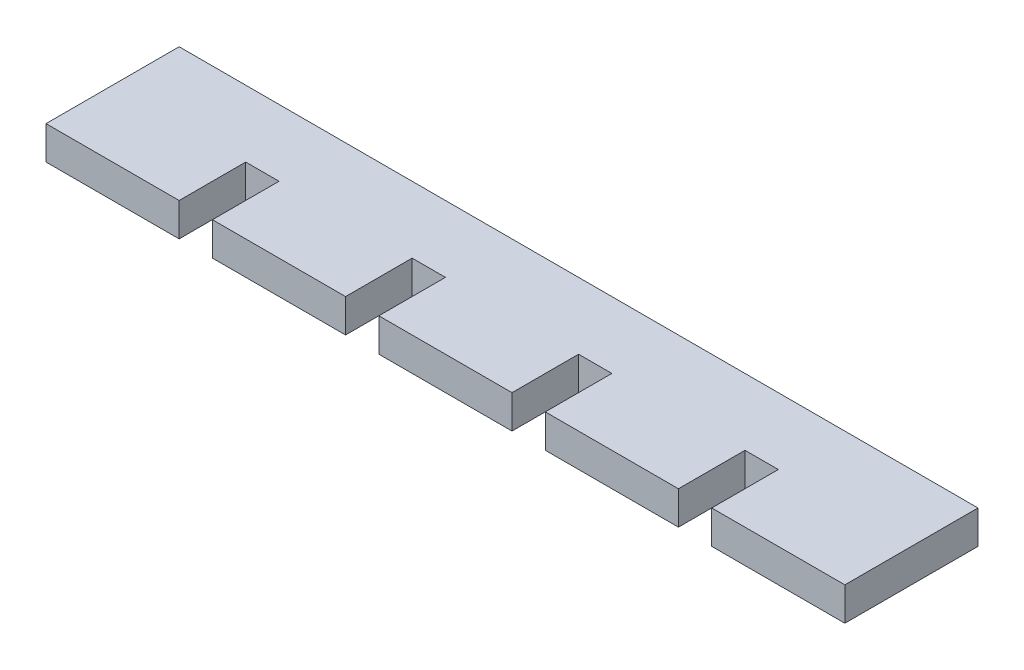
ISO-10303-21;
HEADER;
FILE_DESCRIPTION(('STEP AP214'),'2;1');
FILE_NAME('part.step','',(''),(''),'','','');
FILE_SCHEMA(('AUTOMOTIVE_DESIGN { 1 0 10303 214 1 1 1 1 }'));
ENDSEC;
DATA;
#1=APPLICATION_CONTEXT('core data for automotive mechanical design processes');
#2=APPLICATION_PROTOCOL_DEFINITION('international standard','automotive_design',2000,#1);
#3=PRODUCT_CONTEXT('',#1,'mechanical');
#4=PRODUCT('Part','Part','',(#3));
#5=PRODUCT_RELATED_PRODUCT_CATEGORY('part','',(#4));
#6=PRODUCT_DEFINITION_FORMATION('','',#4);
#7=PRODUCT_DEFINITION_CONTEXT('part definition',#1,'design');
#8=PRODUCT_DEFINITION('design','',#6,#7);
#9=PRODUCT_DEFINITION_SHAPE('','',#8);
#10=(LENGTH_UNIT() NAMED_UNIT(*) SI_UNIT(.MILLI.,.METRE.));
#11=(NAMED_UNIT(*) PLANE_ANGLE_UNIT() SI_UNIT($,.RADIAN.));
#12=(NAMED_UNIT(*) SI_UNIT($,.STERADIAN.) SOLID_ANGLE_UNIT());
#13=UNCERTAINTY_MEASURE_WITH_UNIT(LENGTH_MEASURE(1.E-05),#10,'distance_accuracy_value','');
#14=(GEOMETRIC_REPRESENTATION_CONTEXT(3) GLOBAL_UNCERTAINTY_ASSIGNED_CONTEXT((#13)) GLOBAL_UNIT_ASSIGNED_CONTEXT((#10,
#11,#12)) REPRESENTATION_CONTEXT('',''));
#15=CARTESIAN_POINT('',(0.,0.,0.));
#16=DIRECTION('',(0.,0.,1.));
#17=DIRECTION('',(1.,0.,0.));
#18=AXIS2_PLACEMENT_3D('',#15,#16,#17);
#19=CARTESIAN_POINT('',(0.,3.175,12.7));
#20=DIRECTION('',(0.,0.,-1.));
#21=DIRECTION('',(-1.,0.,0.));
#22=AXIS2_PLACEMENT_3D('',#19,#20,#21);
#23=PLANE('',#22);
#24=DIRECTION('',(1.,0.,0.));
#25=VECTOR('',#24,1.);
#26=CARTESIAN_POINT('',(0.,3.175,12.7));
#27=LINE('',#26,#25);
#28=CARTESIAN_POINT('',(31.75,3.175,12.7));
#29=VERTEX_POINT('',#28);
#30=CARTESIAN_POINT('',(44.45,3.175,12.7));
#31=VERTEX_POINT('',#30);
#32=EDGE_CURVE('E338',#29,#31,#27,.T.);
#33=ORIENTED_EDGE('',*,*,#32,.F.);
#34=DIRECTION('',(0.,1.,0.));
#35=VECTOR('',#34,1.);
#36=CARTESIAN_POINT('',(31.75,0.,12.7));
#37=LINE('',#36,#35);
#38=CARTESIAN_POINT('',(31.75,0.,12.7));
#39=VERTEX_POINT('',#38);
#40=EDGE_CURVE('E208',#39,#29,#37,.T.);
#41=ORIENTED_EDGE('',*,*,#40,.F.);
#42=DIRECTION('',(1.,0.,0.));
#43=VECTOR('',#42,1.);
#44=CARTESIAN_POINT('',(0.,0.,12.7));
#45=LINE('',#44,#43);
#46=CARTESIAN_POINT('',(44.45,0.,12.7));
#47=VERTEX_POINT('',#46);
#48=EDGE_CURVE('E352',#39,#47,#45,.T.);
#49=ORIENTED_EDGE('',*,*,#48,.T.);
#50=DIRECTION('',(0.,1.,0.));
#51=VECTOR('',#50,1.);
#52=CARTESIAN_POINT('',(44.45,0.,12.7));
#53=LINE('',#52,#51);
#54=EDGE_CURVE('E56',#47,#31,#53,.T.);
#55=ORIENTED_EDGE('',*,*,#54,.T.);
#56=EDGE_LOOP('',(#33,#41,#49,#55));
#57=FACE_BOUND('',#56,.T.);
#58=ADVANCED_FACE('F33',(#57),#23,.F.);
#59=CARTESIAN_POINT('',(47.625,3.175,12.7));
#60=VERTEX_POINT('',#59);
#61=CARTESIAN_POINT('',(60.325,3.175,12.7));
#62=VERTEX_POINT('',#61);
#63=EDGE_CURVE('E336',#60,#62,#27,.T.);
#64=ORIENTED_EDGE('',*,*,#63,.F.);
#65=DIRECTION('',(0.,1.,0.));
#66=VECTOR('',#65,1.);
#67=CARTESIAN_POINT('',(47.625,0.,12.7));
#68=LINE('',#67,#66);
#69=CARTESIAN_POINT('',(47.625,0.,12.7));
#70=VERTEX_POINT('',#69);
#71=EDGE_CURVE('E230',#70,#60,#68,.T.);
#72=ORIENTED_EDGE('',*,*,#71,.F.);
#73=CARTESIAN_POINT('',(60.325,0.,12.7));
#74=VERTEX_POINT('',#73);
#75=EDGE_CURVE('E354',#70,#74,#45,.T.);
#76=ORIENTED_EDGE('',*,*,#75,.T.);
#77=DIRECTION('',(0.,1.,0.));
#78=VECTOR('',#77,1.);
#79=CARTESIAN_POINT('',(60.325,0.,12.7));
#80=LINE('',#79,#78);
#81=EDGE_CURVE('E48',#74,#62,#80,.T.);
#82=ORIENTED_EDGE('',*,*,#81,.T.);
#83=EDGE_LOOP('',(#64,#72,#76,#82));
#84=FACE_BOUND('',#83,.T.);
#85=ADVANCED_FACE('F381',(#84),#23,.F.);
#86=CARTESIAN_POINT('',(63.5,3.175,12.7));
#87=VERTEX_POINT('',#86);
#88=CARTESIAN_POINT('',(76.2,3.175,12.7));
#89=VERTEX_POINT('',#88);
#90=EDGE_CURVE('E285',#87,#89,#27,.T.);
#91=ORIENTED_EDGE('',*,*,#90,.F.);
#92=DIRECTION('',(0.,1.,0.));
#93=VECTOR('',#92,1.);
#94=CARTESIAN_POINT('',(63.5,0.,12.7));
#95=LINE('',#94,#93);
#96=CARTESIAN_POINT('',(63.5,0.,12.7));
#97=VERTEX_POINT('',#96);
#98=EDGE_CURVE('E252',#97,#87,#95,.T.);
#99=ORIENTED_EDGE('',*,*,#98,.F.);
#100=CARTESIAN_POINT('',(76.2,0.,12.7));
#101=VERTEX_POINT('',#100);
#102=EDGE_CURVE('E298',#97,#101,#45,.T.);
#103=ORIENTED_EDGE('',*,*,#102,.T.);
#104=DIRECTION('',(0.,-1.,0.));
#105=VECTOR('',#104,1.);
#106=CARTESIAN_POINT('',(76.2,3.175,12.7));
#107=LINE('',#106,#105);
#108=EDGE_CURVE('E41',#89,#101,#107,.T.);
#109=ORIENTED_EDGE('',*,*,#108,.F.);
#110=EDGE_LOOP('',(#91,#99,#103,#109));
#111=FACE_BOUND('',#110,.T.);
#112=ADVANCED_FACE('F361',(#111),#23,.F.);
#113=CARTESIAN_POINT('',(15.875,0.,12.7));
#114=VERTEX_POINT('',#113);
#115=CARTESIAN_POINT('',(28.575,0.,12.7));
#116=VERTEX_POINT('',#115);
#117=EDGE_CURVE('E303',#114,#116,#45,.T.);
#118=ORIENTED_EDGE('',*,*,#117,.T.);
#119=DIRECTION('',(0.,1.,0.));
#120=VECTOR('',#119,1.);
#121=CARTESIAN_POINT('',(28.575,0.,12.7));
#122=LINE('',#121,#120);
#123=CARTESIAN_POINT('',(28.575,3.175,12.7));
#124=VERTEX_POINT('',#123);
#125=EDGE_CURVE('E182',#116,#124,#122,.T.);
#126=ORIENTED_EDGE('',*,*,#125,.T.);
#127=CARTESIAN_POINT('',(15.875,3.175,12.7));
#128=VERTEX_POINT('',#127);
#129=EDGE_CURVE('E291',#128,#124,#27,.T.);
#130=ORIENTED_EDGE('',*,*,#129,.F.);
#131=DIRECTION('',(0.,1.,0.));
#132=VECTOR('',#131,1.);
#133=CARTESIAN_POINT('',(15.875,0.,12.7));
#134=LINE('',#133,#132);
#135=EDGE_CURVE('E276',#114,#128,#134,.T.);
#136=ORIENTED_EDGE('',*,*,#135,.F.);
#137=EDGE_LOOP('',(#118,#126,#130,#136));
#138=FACE_BOUND('',#137,.T.);
#139=ADVANCED_FACE('F351',(#138),#23,.F.);
#140=CARTESIAN_POINT('',(0.,3.175,0.));
#141=DIRECTION('',(1.,0.,0.));
#142=DIRECTION('',(0.,0.,-1.));
#143=AXIS2_PLACEMENT_3D('',#140,#141,#142);
#144=PLANE('',#143);
#145=DIRECTION('',(0.,0.,1.));
#146=VECTOR('',#145,1.);
#147=CARTESIAN_POINT('',(0.,0.,0.));
#148=LINE('',#147,#146);
#149=CARTESIAN_POINT('',(0.,0.,0.));
#150=VERTEX_POINT('',#149);
#151=CARTESIAN_POINT('',(0.,0.,12.7));
#152=VERTEX_POINT('',#151);
#153=EDGE_CURVE('E275',#150,#152,#148,.T.);
#154=ORIENTED_EDGE('',*,*,#153,.T.);
#155=DIRECTION('',(0.,-1.,0.));
#156=VECTOR('',#155,1.);
#157=CARTESIAN_POINT('',(0.,3.175,12.7));
#158=LINE('',#157,#156);
#159=CARTESIAN_POINT('',(0.,3.175,12.7));
#160=VERTEX_POINT('',#159);
#161=EDGE_CURVE('E11',#160,#152,#158,.T.);
#162=ORIENTED_EDGE('',*,*,#161,.F.);
#163=DIRECTION('',(0.,0.,1.));
#164=VECTOR('',#163,1.);
#165=CARTESIAN_POINT('',(0.,3.175,0.));
#166=LINE('',#165,#164);
#167=CARTESIAN_POINT('',(0.,3.175,0.));
#168=VERTEX_POINT('',#167);
#169=EDGE_CURVE('E282',#168,#160,#166,.T.);
#170=ORIENTED_EDGE('',*,*,#169,.F.);
#171=DIRECTION('',(0.,-1.,0.));
#172=VECTOR('',#171,1.);
#173=CARTESIAN_POINT('',(0.,3.175,0.));
#174=LINE('',#173,#172);
#175=EDGE_CURVE('E295',#168,#150,#174,.T.);
#176=ORIENTED_EDGE('',*,*,#175,.T.);
#177=EDGE_LOOP('',(#154,#162,#170,#176));
#178=FACE_BOUND('',#177,.T.);
#179=ADVANCED_FACE('F35',(#178),#144,.F.);
#180=CARTESIAN_POINT('',(12.7,0.,12.7));
#181=VERTEX_POINT('',#180);
#182=EDGE_CURVE('E299',#152,#181,#45,.T.);
#183=ORIENTED_EDGE('',*,*,#182,.T.);
#184=DIRECTION('',(0.,1.,0.));
#185=VECTOR('',#184,1.);
#186=CARTESIAN_POINT('',(12.7,0.,12.7));
#187=LINE('',#186,#185);
#188=CARTESIAN_POINT('',(12.7,3.175,12.7));
#189=VERTEX_POINT('',#188);
#190=EDGE_CURVE('E278',#181,#189,#187,.T.);
#191=ORIENTED_EDGE('',*,*,#190,.T.);
#192=EDGE_CURVE('E287',#160,#189,#27,.T.);
#193=ORIENTED_EDGE('',*,*,#192,.F.);
#194=ORIENTED_EDGE('',*,*,#161,.T.);
#195=EDGE_LOOP('',(#183,#191,#193,#194));
#196=FACE_BOUND('',#195,.T.);
#197=ADVANCED_FACE('F382',(#196),#23,.F.);
#198=CARTESIAN_POINT('',(76.2,3.175,0.));
#199=DIRECTION('',(-1.,0.,0.));
#200=DIRECTION('',(0.,0.,1.));
#201=AXIS2_PLACEMENT_3D('',#198,#199,#200);
#202=PLANE('',#201);
#203=DIRECTION('',(0.,0.,-1.));
#204=VECTOR('',#203,1.);
#205=CARTESIAN_POINT('',(76.2,0.,0.));
#206=LINE('',#205,#204);
#207=CARTESIAN_POINT('',(76.2,0.,0.));
#208=VERTEX_POINT('',#207);
#209=EDGE_CURVE('E302',#101,#208,#206,.T.);
#210=ORIENTED_EDGE('',*,*,#209,.T.);
#211=DIRECTION('',(0.,-1.,0.));
#212=VECTOR('',#211,1.);
#213=CARTESIAN_POINT('',(76.2,3.175,0.));
#214=LINE('',#213,#212);
#215=CARTESIAN_POINT('',(76.2,3.175,0.));
#216=VERTEX_POINT('',#215);
#217=EDGE_CURVE('E308',#216,#208,#214,.T.);
#218=ORIENTED_EDGE('',*,*,#217,.F.);
#219=DIRECTION('',(0.,0.,-1.));
#220=VECTOR('',#219,1.);
#221=CARTESIAN_POINT('',(76.2,3.175,0.));
#222=LINE('',#221,#220);
#223=EDGE_CURVE('E290',#89,#216,#222,.T.);
#224=ORIENTED_EDGE('',*,*,#223,.F.);
#225=ORIENTED_EDGE('',*,*,#108,.T.);
#226=EDGE_LOOP('',(#210,#218,#224,#225));
#227=FACE_BOUND('',#226,.T.);
#228=ADVANCED_FACE('F315',(#227),#202,.F.);
#229=CARTESIAN_POINT('',(0.,3.175,0.));
#230=DIRECTION('',(0.,0.,1.));
#231=DIRECTION('',(1.,0.,0.));
#232=AXIS2_PLACEMENT_3D('',#229,#230,#231);
#233=PLANE('',#232);
#234=DIRECTION('',(-1.,0.,0.));
#235=VECTOR('',#234,1.);
#236=CARTESIAN_POINT('',(0.,0.,0.));
#237=LINE('',#236,#235);
#238=EDGE_CURVE('E286',#208,#150,#237,.T.);
#239=ORIENTED_EDGE('',*,*,#238,.T.);
#240=ORIENTED_EDGE('',*,*,#175,.F.);
#241=DIRECTION('',(-1.,0.,0.));
#242=VECTOR('',#241,1.);
#243=CARTESIAN_POINT('',(0.,3.175,0.));
#244=LINE('',#243,#242);
#245=EDGE_CURVE('E293',#216,#168,#244,.T.);
#246=ORIENTED_EDGE('',*,*,#245,.F.);
#247=ORIENTED_EDGE('',*,*,#217,.T.);
#248=EDGE_LOOP('',(#239,#240,#246,#247));
#249=FACE_BOUND('',#248,.T.);
#250=ADVANCED_FACE('F324',(#249),#233,.F.);
#251=CARTESIAN_POINT('',(0.,3.175,0.));
#252=DIRECTION('',(0.,1.,0.));
#253=DIRECTION('',(0.,0.,1.));
#254=AXIS2_PLACEMENT_3D('',#251,#252,#253);
#255=PLANE('',#254);
#256=DIRECTION('',(0.,0.,-1.));
#257=VECTOR('',#256,1.);
#258=CARTESIAN_POINT('',(31.75,3.175,6.35000000000001));
#259=LINE('',#258,#257);
#260=CARTESIAN_POINT('',(31.75,3.175,6.35000000000001));
#261=VERTEX_POINT('',#260);
#262=EDGE_CURVE('E195',#29,#261,#259,.T.);
#263=ORIENTED_EDGE('',*,*,#262,.F.);
#264=ORIENTED_EDGE('',*,*,#32,.T.);
#265=DIRECTION('',(0.,0.,1.));
#266=VECTOR('',#265,1.);
#267=CARTESIAN_POINT('',(44.45,3.175,6.35000000000001));
#268=LINE('',#267,#266);
#269=CARTESIAN_POINT('',(44.45,3.175,6.35000000000001));
#270=VERTEX_POINT('',#269);
#271=EDGE_CURVE('E224',#270,#31,#268,.T.);
#272=ORIENTED_EDGE('',*,*,#271,.F.);
#273=DIRECTION('',(-1.,0.,0.));
#274=VECTOR('',#273,1.);
#275=CARTESIAN_POINT('',(44.45,3.175,6.35000000000001));
#276=LINE('',#275,#274);
#277=CARTESIAN_POINT('',(47.625,3.175,6.35000000000001));
#278=VERTEX_POINT('',#277);
#279=EDGE_CURVE('E221',#278,#270,#276,.T.);
#280=ORIENTED_EDGE('',*,*,#279,.F.);
#281=DIRECTION('',(0.,0.,-1.));
#282=VECTOR('',#281,1.);
#283=CARTESIAN_POINT('',(47.625,3.175,6.35000000000001));
#284=LINE('',#283,#282);
#285=EDGE_CURVE('E215',#60,#278,#284,.T.);
#286=ORIENTED_EDGE('',*,*,#285,.F.);
#287=ORIENTED_EDGE('',*,*,#63,.T.);
#288=DIRECTION('',(0.,0.,1.));
#289=VECTOR('',#288,1.);
#290=CARTESIAN_POINT('',(60.325,3.175,6.35000000000001));
#291=LINE('',#290,#289);
#292=CARTESIAN_POINT('',(60.325,3.175,6.35000000000001));
#293=VERTEX_POINT('',#292);
#294=EDGE_CURVE('E247',#293,#62,#291,.T.);
#295=ORIENTED_EDGE('',*,*,#294,.F.);
#296=DIRECTION('',(-1.,0.,0.));
#297=VECTOR('',#296,1.);
#298=CARTESIAN_POINT('',(60.325,3.175,6.35000000000001));
#299=LINE('',#298,#297);
#300=CARTESIAN_POINT('',(63.5,3.175,6.35000000000001));
#301=VERTEX_POINT('',#300);
#302=EDGE_CURVE('E244',#301,#293,#299,.T.);
#303=ORIENTED_EDGE('',*,*,#302,.F.);
#304=DIRECTION('',(0.,0.,-1.));
#305=VECTOR('',#304,1.);
#306=CARTESIAN_POINT('',(63.5,3.175,6.35000000000001));
#307=LINE('',#306,#305);
#308=EDGE_CURVE('E238',#87,#301,#307,.T.);
#309=ORIENTED_EDGE('',*,*,#308,.F.);
#310=ORIENTED_EDGE('',*,*,#90,.T.);
#311=ORIENTED_EDGE('',*,*,#223,.T.);
#312=ORIENTED_EDGE('',*,*,#245,.T.);
#313=ORIENTED_EDGE('',*,*,#169,.T.);
#314=ORIENTED_EDGE('',*,*,#192,.T.);
#315=DIRECTION('',(0.,0.,1.));
#316=VECTOR('',#315,1.);
#317=CARTESIAN_POINT('',(12.7,3.175,6.35000000000001));
#318=LINE('',#317,#316);
#319=CARTESIAN_POINT('',(12.7,3.175,6.35000000000001));
#320=VERTEX_POINT('',#319);
#321=EDGE_CURVE('E269',#320,#189,#318,.T.);
#322=ORIENTED_EDGE('',*,*,#321,.F.);
#323=DIRECTION('',(-1.,0.,0.));
#324=VECTOR('',#323,1.);
#325=CARTESIAN_POINT('',(12.7,3.175,6.35000000000001));
#326=LINE('',#325,#324);
#327=CARTESIAN_POINT('',(15.875,3.175,6.35000000000001));
#328=VERTEX_POINT('',#327);
#329=EDGE_CURVE('E207',#328,#320,#326,.T.);
#330=ORIENTED_EDGE('',*,*,#329,.F.);
#331=DIRECTION('',(0.,0.,-1.));
#332=VECTOR('',#331,1.);
#333=CARTESIAN_POINT('',(15.875,3.175,6.35000000000001));
#334=LINE('',#333,#332);
#335=EDGE_CURVE('E260',#128,#328,#334,.T.);
#336=ORIENTED_EDGE('',*,*,#335,.F.);
#337=ORIENTED_EDGE('',*,*,#129,.T.);
#338=DIRECTION('',(0.,0.,1.));
#339=VECTOR('',#338,1.);
#340=CARTESIAN_POINT('',(28.575,3.175,6.35000000000001));
#341=LINE('',#340,#339);
#342=CARTESIAN_POINT('',(28.575,3.175,6.35000000000001));
#343=VERTEX_POINT('',#342);
#344=EDGE_CURVE('E198',#343,#124,#341,.T.);
#345=ORIENTED_EDGE('',*,*,#344,.F.);
#346=DIRECTION('',(-1.,0.,0.));
#347=VECTOR('',#346,1.);
#348=CARTESIAN_POINT('',(28.575,3.175,6.35000000000001));
#349=LINE('',#348,#347);
#350=EDGE_CURVE('E179',#261,#343,#349,.T.);
#351=ORIENTED_EDGE('',*,*,#350,.F.);
#352=EDGE_LOOP('',(#263,#264,#272,#280,#286,#287,#295,#303,#309,#310,#311,#312,#313,#314,#322,
#330,#336,#337,#345,#351));
#353=FACE_BOUND('',#352,.T.);
#354=ADVANCED_FACE('F331',(#353),#255,.T.);
#355=CARTESIAN_POINT('',(0.,0.,0.));
#356=DIRECTION('',(0.,1.,0.));
#357=DIRECTION('',(0.,0.,1.));
#358=AXIS2_PLACEMENT_3D('',#355,#356,#357);
#359=PLANE('',#358);
#360=ORIENTED_EDGE('',*,*,#48,.F.);
#361=DIRECTION('',(0.,0.,-1.));
#362=VECTOR('',#361,1.);
#363=CARTESIAN_POINT('',(31.75,0.,6.35000000000001));
#364=LINE('',#363,#362);
#365=CARTESIAN_POINT('',(31.75,0.,6.35000000000001));
#366=VERTEX_POINT('',#365);
#367=EDGE_CURVE('E183',#39,#366,#364,.T.);
#368=ORIENTED_EDGE('',*,*,#367,.T.);
#369=DIRECTION('',(-1.,0.,0.));
#370=VECTOR('',#369,1.);
#371=CARTESIAN_POINT('',(28.575,0.,6.35000000000001));
#372=LINE('',#371,#370);
#373=CARTESIAN_POINT('',(28.575,0.,6.35000000000001));
#374=VERTEX_POINT('',#373);
#375=EDGE_CURVE('E176',#366,#374,#372,.T.);
#376=ORIENTED_EDGE('',*,*,#375,.T.);
#377=DIRECTION('',(0.,0.,1.));
#378=VECTOR('',#377,1.);
#379=CARTESIAN_POINT('',(28.575,0.,6.35000000000001));
#380=LINE('',#379,#378);
#381=EDGE_CURVE('E186',#374,#116,#380,.T.);
#382=ORIENTED_EDGE('',*,*,#381,.T.);
#383=ORIENTED_EDGE('',*,*,#117,.F.);
#384=DIRECTION('',(0.,0.,-1.));
#385=VECTOR('',#384,1.);
#386=CARTESIAN_POINT('',(15.875,0.,6.35000000000001));
#387=LINE('',#386,#385);
#388=CARTESIAN_POINT('',(15.875,0.,6.35000000000001));
#389=VERTEX_POINT('',#388);
#390=EDGE_CURVE('E263',#114,#389,#387,.T.);
#391=ORIENTED_EDGE('',*,*,#390,.T.);
#392=DIRECTION('',(-1.,0.,0.));
#393=VECTOR('',#392,1.);
#394=CARTESIAN_POINT('',(12.7,0.,6.35000000000001));
#395=LINE('',#394,#393);
#396=CARTESIAN_POINT('',(12.7,0.,6.35000000000001));
#397=VERTEX_POINT('',#396);
#398=EDGE_CURVE('E256',#389,#397,#395,.T.);
#399=ORIENTED_EDGE('',*,*,#398,.T.);
#400=DIRECTION('',(0.,0.,1.));
#401=VECTOR('',#400,1.);
#402=CARTESIAN_POINT('',(12.7,0.,6.35000000000001));
#403=LINE('',#402,#401);
#404=EDGE_CURVE('E259',#397,#181,#403,.T.);
#405=ORIENTED_EDGE('',*,*,#404,.T.);
#406=ORIENTED_EDGE('',*,*,#182,.F.);
#407=ORIENTED_EDGE('',*,*,#153,.F.);
#408=ORIENTED_EDGE('',*,*,#238,.F.);
#409=ORIENTED_EDGE('',*,*,#209,.F.);
#410=ORIENTED_EDGE('',*,*,#102,.F.);
#411=DIRECTION('',(0.,0.,-1.));
#412=VECTOR('',#411,1.);
#413=CARTESIAN_POINT('',(63.5,0.,6.35000000000001));
#414=LINE('',#413,#412);
#415=CARTESIAN_POINT('',(63.5,0.,6.35000000000001));
#416=VERTEX_POINT('',#415);
#417=EDGE_CURVE('E240',#97,#416,#414,.T.);
#418=ORIENTED_EDGE('',*,*,#417,.T.);
#419=DIRECTION('',(-1.,0.,0.));
#420=VECTOR('',#419,1.);
#421=CARTESIAN_POINT('',(60.325,0.,6.35000000000001));
#422=LINE('',#421,#420);
#423=CARTESIAN_POINT('',(60.325,0.,6.35000000000001));
#424=VERTEX_POINT('',#423);
#425=EDGE_CURVE('E234',#416,#424,#422,.T.);
#426=ORIENTED_EDGE('',*,*,#425,.T.);
#427=DIRECTION('',(0.,0.,1.));
#428=VECTOR('',#427,1.);
#429=CARTESIAN_POINT('',(60.325,0.,6.35000000000001));
#430=LINE('',#429,#428);
#431=EDGE_CURVE('E237',#424,#74,#430,.T.);
#432=ORIENTED_EDGE('',*,*,#431,.T.);
#433=ORIENTED_EDGE('',*,*,#75,.F.);
#434=DIRECTION('',(0.,0.,-1.));
#435=VECTOR('',#434,1.);
#436=CARTESIAN_POINT('',(47.625,0.,6.35000000000001));
#437=LINE('',#436,#435);
#438=CARTESIAN_POINT('',(47.625,0.,6.35000000000001));
#439=VERTEX_POINT('',#438);
#440=EDGE_CURVE('E217',#70,#439,#437,.T.);
#441=ORIENTED_EDGE('',*,*,#440,.T.);
#442=DIRECTION('',(-1.,0.,0.));
#443=VECTOR('',#442,1.);
#444=CARTESIAN_POINT('',(44.45,0.,6.35000000000001));
#445=LINE('',#444,#443);
#446=CARTESIAN_POINT('',(44.45,0.,6.35000000000001));
#447=VERTEX_POINT('',#446);
#448=EDGE_CURVE('E211',#439,#447,#445,.T.);
#449=ORIENTED_EDGE('',*,*,#448,.T.);
#450=DIRECTION('',(0.,0.,1.));
#451=VECTOR('',#450,1.);
#452=CARTESIAN_POINT('',(44.45,0.,6.35000000000001));
#453=LINE('',#452,#451);
#454=EDGE_CURVE('E214',#447,#47,#453,.T.);
#455=ORIENTED_EDGE('',*,*,#454,.T.);
#456=EDGE_LOOP('',(#360,#368,#376,#382,#383,#391,#399,#405,#406,#407,#408,#409,#410,#418,#426,
#432,#433,#441,#449,#455));
#457=FACE_BOUND('',#456,.T.);
#458=ADVANCED_FACE('F194',(#457),#359,.F.);
#459=CARTESIAN_POINT('',(12.7,0.,6.35000000000001));
#460=DIRECTION('',(0.,0.,-1.));
#461=DIRECTION('',(-1.,0.,0.));
#462=AXIS2_PLACEMENT_3D('',#459,#460,#461);
#463=PLANE('',#462);
#464=ORIENTED_EDGE('',*,*,#329,.T.);
#465=DIRECTION('',(0.,1.,0.));
#466=VECTOR('',#465,1.);
#467=CARTESIAN_POINT('',(12.7,0.,6.35000000000001));
#468=LINE('',#467,#466);
#469=EDGE_CURVE('E266',#397,#320,#468,.T.);
#470=ORIENTED_EDGE('',*,*,#469,.F.);
#471=ORIENTED_EDGE('',*,*,#398,.F.);
#472=DIRECTION('',(0.,1.,0.));
#473=VECTOR('',#472,1.);
#474=CARTESIAN_POINT('',(15.875,0.,6.35000000000001));
#475=LINE('',#474,#473);
#476=EDGE_CURVE('E273',#389,#328,#475,.T.);
#477=ORIENTED_EDGE('',*,*,#476,.T.);
#478=EDGE_LOOP('',(#464,#470,#471,#477));
#479=FACE_BOUND('',#478,.T.);
#480=ADVANCED_FACE('F429',(#479),#463,.F.);
#481=CARTESIAN_POINT('',(15.875,0.,6.35000000000001));
#482=DIRECTION('',(1.,0.,0.));
#483=DIRECTION('',(0.,0.,-1.));
#484=AXIS2_PLACEMENT_3D('',#481,#482,#483);
#485=PLANE('',#484);
#486=ORIENTED_EDGE('',*,*,#335,.T.);
#487=ORIENTED_EDGE('',*,*,#476,.F.);
#488=ORIENTED_EDGE('',*,*,#390,.F.);
#489=ORIENTED_EDGE('',*,*,#135,.T.);
#490=EDGE_LOOP('',(#486,#487,#488,#489));
#491=FACE_BOUND('',#490,.T.);
#492=ADVANCED_FACE('F418',(#491),#485,.F.);
#493=CARTESIAN_POINT('',(12.7,0.,6.35000000000001));
#494=DIRECTION('',(-1.,0.,0.));
#495=DIRECTION('',(0.,0.,1.));
#496=AXIS2_PLACEMENT_3D('',#493,#494,#495);
#497=PLANE('',#496);
#498=ORIENTED_EDGE('',*,*,#321,.T.);
#499=ORIENTED_EDGE('',*,*,#190,.F.);
#500=ORIENTED_EDGE('',*,*,#404,.F.);
#501=ORIENTED_EDGE('',*,*,#469,.T.);
#502=EDGE_LOOP('',(#498,#499,#500,#501));
#503=FACE_BOUND('',#502,.T.);
#504=ADVANCED_FACE('F413',(#503),#497,.F.);
#505=CARTESIAN_POINT('',(60.325,0.,6.35000000000001));
#506=DIRECTION('',(0.,0.,-1.));
#507=DIRECTION('',(-1.,0.,0.));
#508=AXIS2_PLACEMENT_3D('',#505,#506,#507);
#509=PLANE('',#508);
#510=ORIENTED_EDGE('',*,*,#302,.T.);
#511=DIRECTION('',(0.,1.,0.));
#512=VECTOR('',#511,1.);
#513=CARTESIAN_POINT('',(60.325,0.,6.35000000000001));
#514=LINE('',#513,#512);
#515=EDGE_CURVE('E243',#424,#293,#514,.T.);
#516=ORIENTED_EDGE('',*,*,#515,.F.);
#517=ORIENTED_EDGE('',*,*,#425,.F.);
#518=DIRECTION('',(0.,1.,0.));
#519=VECTOR('',#518,1.);
#520=CARTESIAN_POINT('',(63.5,0.,6.35000000000001));
#521=LINE('',#520,#519);
#522=EDGE_CURVE('E225',#416,#301,#521,.T.);
#523=ORIENTED_EDGE('',*,*,#522,.T.);
#524=EDGE_LOOP('',(#510,#516,#517,#523));
#525=FACE_BOUND('',#524,.T.);
#526=ADVANCED_FACE('F366',(#525),#509,.F.);
#527=CARTESIAN_POINT('',(63.5,0.,6.35000000000001));
#528=DIRECTION('',(1.,0.,0.));
#529=DIRECTION('',(0.,0.,-1.));
#530=AXIS2_PLACEMENT_3D('',#527,#528,#529);
#531=PLANE('',#530);
#532=ORIENTED_EDGE('',*,*,#308,.T.);
#533=ORIENTED_EDGE('',*,*,#522,.F.);
#534=ORIENTED_EDGE('',*,*,#417,.F.);
#535=ORIENTED_EDGE('',*,*,#98,.T.);
#536=EDGE_LOOP('',(#532,#533,#534,#535));
#537=FACE_BOUND('',#536,.T.);
#538=ADVANCED_FACE('F363',(#537),#531,.F.);
#539=CARTESIAN_POINT('',(60.325,0.,6.35000000000001));
#540=DIRECTION('',(-1.,0.,0.));
#541=DIRECTION('',(0.,0.,1.));
#542=AXIS2_PLACEMENT_3D('',#539,#540,#541);
#543=PLANE('',#542);
#544=ORIENTED_EDGE('',*,*,#294,.T.);
#545=ORIENTED_EDGE('',*,*,#81,.F.);
#546=ORIENTED_EDGE('',*,*,#431,.F.);
#547=ORIENTED_EDGE('',*,*,#515,.T.);
#548=EDGE_LOOP('',(#544,#545,#546,#547));
#549=FACE_BOUND('',#548,.T.);
#550=ADVANCED_FACE('F367',(#549),#543,.F.);
#551=CARTESIAN_POINT('',(44.45,0.,6.35000000000001));
#552=DIRECTION('',(0.,0.,-1.));
#553=DIRECTION('',(-1.,0.,0.));
#554=AXIS2_PLACEMENT_3D('',#551,#552,#553);
#555=PLANE('',#554);
#556=ORIENTED_EDGE('',*,*,#279,.T.);
#557=DIRECTION('',(0.,1.,0.));
#558=VECTOR('',#557,1.);
#559=CARTESIAN_POINT('',(44.45,0.,6.35000000000001));
#560=LINE('',#559,#558);
#561=EDGE_CURVE('E220',#447,#270,#560,.T.);
#562=ORIENTED_EDGE('',*,*,#561,.F.);
#563=ORIENTED_EDGE('',*,*,#448,.F.);
#564=DIRECTION('',(0.,1.,0.));
#565=VECTOR('',#564,1.);
#566=CARTESIAN_POINT('',(47.625,0.,6.35000000000001));
#567=LINE('',#566,#565);
#568=EDGE_CURVE('E203',#439,#278,#567,.T.);
#569=ORIENTED_EDGE('',*,*,#568,.T.);
#570=EDGE_LOOP('',(#556,#562,#563,#569));
#571=FACE_BOUND('',#570,.T.);
#572=ADVANCED_FACE('F369',(#571),#555,.F.);
#573=CARTESIAN_POINT('',(47.625,0.,6.35000000000001));
#574=DIRECTION('',(1.,0.,0.));
#575=DIRECTION('',(0.,0.,-1.));
#576=AXIS2_PLACEMENT_3D('',#573,#574,#575);
#577=PLANE('',#576);
#578=ORIENTED_EDGE('',*,*,#285,.T.);
#579=ORIENTED_EDGE('',*,*,#568,.F.);
#580=ORIENTED_EDGE('',*,*,#440,.F.);
#581=ORIENTED_EDGE('',*,*,#71,.T.);
#582=EDGE_LOOP('',(#578,#579,#580,#581));
#583=FACE_BOUND('',#582,.T.);
#584=ADVANCED_FACE('F375',(#583),#577,.F.);
#585=CARTESIAN_POINT('',(44.45,0.,6.35000000000001));
#586=DIRECTION('',(-1.,0.,0.));
#587=DIRECTION('',(0.,0.,1.));
#588=AXIS2_PLACEMENT_3D('',#585,#586,#587);
#589=PLANE('',#588);
#590=ORIENTED_EDGE('',*,*,#271,.T.);
#591=ORIENTED_EDGE('',*,*,#54,.F.);
#592=ORIENTED_EDGE('',*,*,#454,.F.);
#593=ORIENTED_EDGE('',*,*,#561,.T.);
#594=EDGE_LOOP('',(#590,#591,#592,#593));
#595=FACE_BOUND('',#594,.T.);
#596=ADVANCED_FACE('F508',(#595),#589,.F.);
#597=CARTESIAN_POINT('',(28.575,0.,6.35000000000001));
#598=DIRECTION('',(0.,0.,-1.));
#599=DIRECTION('',(-1.,0.,0.));
#600=AXIS2_PLACEMENT_3D('',#597,#598,#599);
#601=PLANE('',#600);
#602=ORIENTED_EDGE('',*,*,#350,.T.);
#603=DIRECTION('',(0.,1.,0.));
#604=VECTOR('',#603,1.);
#605=CARTESIAN_POINT('',(28.575,0.,6.35000000000001));
#606=LINE('',#605,#604);
#607=EDGE_CURVE('E172',#374,#343,#606,.T.);
#608=ORIENTED_EDGE('',*,*,#607,.F.);
#609=ORIENTED_EDGE('',*,*,#375,.F.);
#610=DIRECTION('',(0.,1.,0.));
#611=VECTOR('',#610,1.);
#612=CARTESIAN_POINT('',(31.75,0.,6.35000000000001));
#613=LINE('',#612,#611);
#614=EDGE_CURVE('E205',#366,#261,#613,.T.);
#615=ORIENTED_EDGE('',*,*,#614,.T.);
#616=EDGE_LOOP('',(#602,#608,#609,#615));
#617=FACE_BOUND('',#616,.T.);
#618=ADVANCED_FACE('F174',(#617),#601,.F.);
#619=CARTESIAN_POINT('',(31.75,0.,6.35000000000001));
#620=DIRECTION('',(1.,0.,0.));
#621=DIRECTION('',(0.,0.,-1.));
#622=AXIS2_PLACEMENT_3D('',#619,#620,#621);
#623=PLANE('',#622);
#624=ORIENTED_EDGE('',*,*,#262,.T.);
#625=ORIENTED_EDGE('',*,*,#614,.F.);
#626=ORIENTED_EDGE('',*,*,#367,.F.);
#627=ORIENTED_EDGE('',*,*,#40,.T.);
#628=EDGE_LOOP('',(#624,#625,#626,#627));
#629=FACE_BOUND('',#628,.T.);
#630=ADVANCED_FACE('F526',(#629),#623,.F.);
#631=CARTESIAN_POINT('',(28.575,0.,6.35000000000001));
#632=DIRECTION('',(-1.,0.,0.));
#633=DIRECTION('',(0.,0.,1.));
#634=AXIS2_PLACEMENT_3D('',#631,#632,#633);
#635=PLANE('',#634);
#636=ORIENTED_EDGE('',*,*,#344,.T.);
#637=ORIENTED_EDGE('',*,*,#125,.F.);
#638=ORIENTED_EDGE('',*,*,#381,.F.);
#639=ORIENTED_EDGE('',*,*,#607,.T.);
#640=EDGE_LOOP('',(#636,#637,#638,#639));
#641=FACE_BOUND('',#640,.T.);
#642=ADVANCED_FACE('F187',(#641),#635,.F.);
#643=CLOSED_SHELL('',(#58,#85,#112,#139,#179,#197,#228,#250,#354,#458,#480,#492,#504,#526,#538,
#550,#572,#584,#596,#618,#630,#642));
#644=MANIFOLD_SOLID_BREP('B2',#643);
#645=ADVANCED_BREP_SHAPE_REPRESENTATION('',(#18,#644),#14);
#646=SHAPE_DEFINITION_REPRESENTATION(#9,#645);
ENDSEC;
END-ISO-10303-21;
